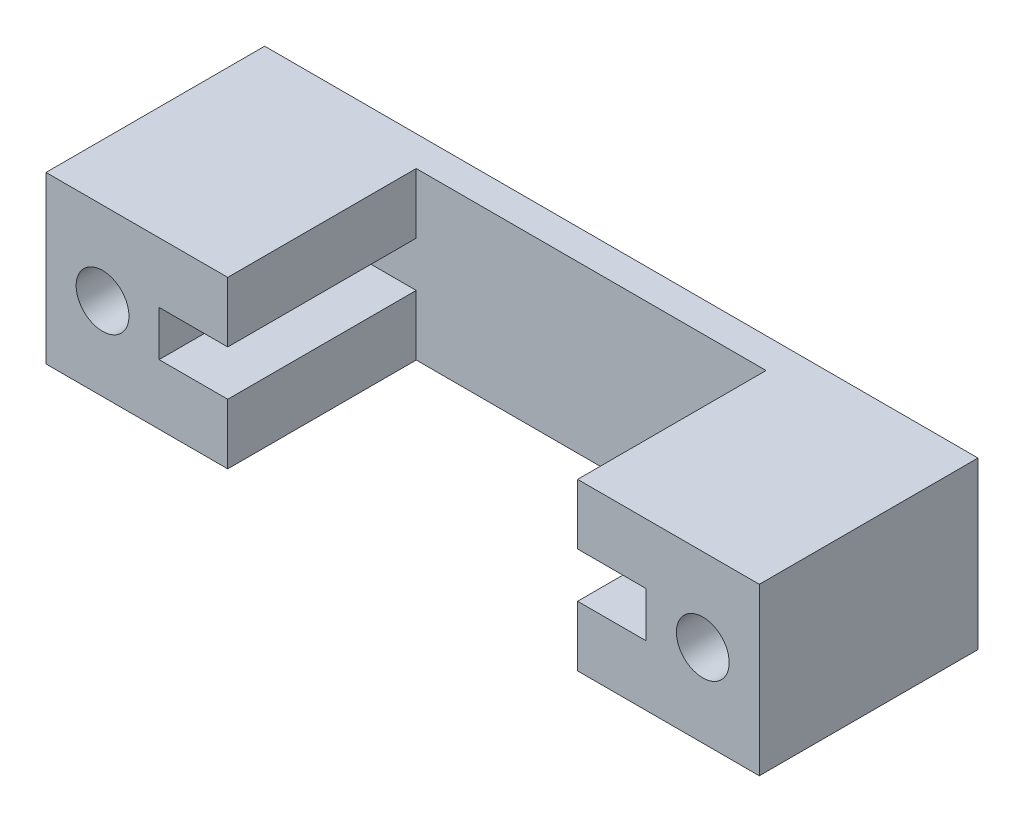
ISO-10303-21;
HEADER;
FILE_DESCRIPTION(('STEP AP214'),'2;1');
FILE_NAME('part.step','',(''),(''),'','','');
FILE_SCHEMA(('AUTOMOTIVE_DESIGN { 1 0 10303 214 1 1 1 1 }'));
ENDSEC;
DATA;
#1=APPLICATION_CONTEXT('core data for automotive mechanical design processes');
#2=APPLICATION_PROTOCOL_DEFINITION('international standard','automotive_design',2000,#1);
#3=PRODUCT_CONTEXT('',#1,'mechanical');
#4=PRODUCT('Part','Part','',(#3));
#5=PRODUCT_RELATED_PRODUCT_CATEGORY('part','',(#4));
#6=PRODUCT_DEFINITION_FORMATION('','',#4);
#7=PRODUCT_DEFINITION_CONTEXT('part definition',#1,'design');
#8=PRODUCT_DEFINITION('design','',#6,#7);
#9=PRODUCT_DEFINITION_SHAPE('','',#8);
#10=(LENGTH_UNIT() NAMED_UNIT(*) SI_UNIT(.MILLI.,.METRE.));
#11=(NAMED_UNIT(*) PLANE_ANGLE_UNIT() SI_UNIT($,.RADIAN.));
#12=(NAMED_UNIT(*) SI_UNIT($,.STERADIAN.) SOLID_ANGLE_UNIT());
#13=UNCERTAINTY_MEASURE_WITH_UNIT(LENGTH_MEASURE(1.E-05),#10,'distance_accuracy_value','');
#14=(GEOMETRIC_REPRESENTATION_CONTEXT(3) GLOBAL_UNCERTAINTY_ASSIGNED_CONTEXT((#13)) GLOBAL_UNIT_ASSIGNED_CONTEXT((#10,
#11,#12)) REPRESENTATION_CONTEXT('',''));
#15=CARTESIAN_POINT('',(0.,0.,0.));
#16=DIRECTION('',(0.,0.,1.));
#17=DIRECTION('',(1.,0.,0.));
#18=AXIS2_PLACEMENT_3D('',#15,#16,#17);
#19=CARTESIAN_POINT('',(0.,0.,2.));
#20=DIRECTION('',(0.,0.,1.));
#21=DIRECTION('',(1.,0.,0.));
#22=AXIS2_PLACEMENT_3D('',#19,#20,#21);
#23=PLANE('',#22);
#24=DIRECTION('',(0.,1.,0.));
#25=VECTOR('',#24,1.);
#26=CARTESIAN_POINT('',(11.6,0.,2.));
#27=LINE('',#26,#25);
#28=CARTESIAN_POINT('',(11.6,-5.5,2.));
#29=VERTEX_POINT('',#28);
#30=CARTESIAN_POINT('',(11.6,-1.5,2.));
#31=VERTEX_POINT('',#30);
#32=EDGE_CURVE('E110',#29,#31,#27,.T.);
#33=ORIENTED_EDGE('',*,*,#32,.T.);
#34=DIRECTION('',(1.,0.,0.));
#35=VECTOR('',#34,1.);
#36=CARTESIAN_POINT('',(0.,-1.5,2.));
#37=LINE('',#36,#35);
#38=CARTESIAN_POINT('',(16.15,-1.5,2.));
#39=VERTEX_POINT('',#38);
#40=EDGE_CURVE('E115',#31,#39,#37,.T.);
#41=ORIENTED_EDGE('',*,*,#40,.T.);
#42=DIRECTION('',(0.,1.,0.));
#43=VECTOR('',#42,1.);
#44=CARTESIAN_POINT('',(16.15,0.,2.));
#45=LINE('',#44,#43);
#46=CARTESIAN_POINT('',(16.15,1.5,2.));
#47=VERTEX_POINT('',#46);
#48=EDGE_CURVE('E250',#39,#47,#45,.T.);
#49=ORIENTED_EDGE('',*,*,#48,.T.);
#50=DIRECTION('',(-1.,0.,0.));
#51=VECTOR('',#50,1.);
#52=CARTESIAN_POINT('',(0.,1.5,2.));
#53=LINE('',#52,#51);
#54=CARTESIAN_POINT('',(11.6,1.5,2.));
#55=VERTEX_POINT('',#54);
#56=EDGE_CURVE('E212',#47,#55,#53,.T.);
#57=ORIENTED_EDGE('',*,*,#56,.T.);
#58=DIRECTION('',(0.,1.,0.));
#59=VECTOR('',#58,1.);
#60=CARTESIAN_POINT('',(11.6,0.,2.));
#61=LINE('',#60,#59);
#62=CARTESIAN_POINT('',(11.6,5.50000000000003,2.));
#63=VERTEX_POINT('',#62);
#64=EDGE_CURVE('E253',#55,#63,#61,.T.);
#65=ORIENTED_EDGE('',*,*,#64,.T.);
#66=DIRECTION('',(-1.,0.,0.));
#67=VECTOR('',#66,1.);
#68=CARTESIAN_POINT('',(0.,5.5,2.));
#69=LINE('',#68,#67);
#70=CARTESIAN_POINT('',(-11.6,5.5,2.));
#71=VERTEX_POINT('',#70);
#72=EDGE_CURVE('E326',#63,#71,#69,.T.);
#73=ORIENTED_EDGE('',*,*,#72,.T.);
#74=DIRECTION('',(0.,-1.,0.));
#75=VECTOR('',#74,1.);
#76=CARTESIAN_POINT('',(-11.6,0.,2.));
#77=LINE('',#76,#75);
#78=CARTESIAN_POINT('',(-11.6,1.5,2.));
#79=VERTEX_POINT('',#78);
#80=EDGE_CURVE('E302',#71,#79,#77,.T.);
#81=ORIENTED_EDGE('',*,*,#80,.T.);
#82=DIRECTION('',(-1.,0.,0.));
#83=VECTOR('',#82,1.);
#84=CARTESIAN_POINT('',(0.,1.5,2.));
#85=LINE('',#84,#83);
#86=CARTESIAN_POINT('',(-16.15,1.5,2.));
#87=VERTEX_POINT('',#86);
#88=EDGE_CURVE('E305',#79,#87,#85,.T.);
#89=ORIENTED_EDGE('',*,*,#88,.T.);
#90=DIRECTION('',(0.,-1.,0.));
#91=VECTOR('',#90,1.);
#92=CARTESIAN_POINT('',(-16.15,0.,2.));
#93=LINE('',#92,#91);
#94=CARTESIAN_POINT('',(-16.15,-1.5,2.));
#95=VERTEX_POINT('',#94);
#96=EDGE_CURVE('E275',#87,#95,#93,.T.);
#97=ORIENTED_EDGE('',*,*,#96,.T.);
#98=DIRECTION('',(1.,0.,0.));
#99=VECTOR('',#98,1.);
#100=CARTESIAN_POINT('',(0.,-1.5,2.));
#101=LINE('',#100,#99);
#102=CARTESIAN_POINT('',(-11.6,-1.5,2.));
#103=VERTEX_POINT('',#102);
#104=EDGE_CURVE('E270',#95,#103,#101,.T.);
#105=ORIENTED_EDGE('',*,*,#104,.T.);
#106=DIRECTION('',(0.,-1.,0.));
#107=VECTOR('',#106,1.);
#108=CARTESIAN_POINT('',(-11.6,0.,2.));
#109=LINE('',#108,#107);
#110=CARTESIAN_POINT('',(-11.6,-5.5,2.));
#111=VERTEX_POINT('',#110);
#112=EDGE_CURVE('E299',#103,#111,#109,.T.);
#113=ORIENTED_EDGE('',*,*,#112,.T.);
#114=DIRECTION('',(1.,0.,0.));
#115=VECTOR('',#114,1.);
#116=CARTESIAN_POINT('',(0.,-5.5,2.));
#117=LINE('',#116,#115);
#118=EDGE_CURVE('E324',#111,#29,#117,.T.);
#119=ORIENTED_EDGE('',*,*,#118,.T.);
#120=EDGE_LOOP('',(#33,#41,#49,#57,#65,#73,#81,#89,#97,#105,#113,#119));
#121=FACE_BOUND('',#120,.T.);
#122=ADVANCED_FACE('F95',(#121),#23,.T.);
#123=CARTESIAN_POINT('',(0.,-5.5,2.));
#124=DIRECTION('',(0.,1.,0.));
#125=DIRECTION('',(0.,0.,1.));
#126=AXIS2_PLACEMENT_3D('',#123,#124,#125);
#127=PLANE('',#126);
#128=DIRECTION('',(1.,0.,0.));
#129=VECTOR('',#128,1.);
#130=CARTESIAN_POINT('',(0.,-5.5,0.));
#131=LINE('',#130,#129);
#132=CARTESIAN_POINT('',(-23.65,-5.5,0.));
#133=VERTEX_POINT('',#132);
#134=CARTESIAN_POINT('',(23.65,-5.5,0.));
#135=VERTEX_POINT('',#134);
#136=EDGE_CURVE('E313',#133,#135,#131,.T.);
#137=ORIENTED_EDGE('',*,*,#136,.T.);
#138=DIRECTION('',(0.,0.,-1.));
#139=VECTOR('',#138,1.);
#140=CARTESIAN_POINT('',(23.65,-5.5,2.));
#141=LINE('',#140,#139);
#142=CARTESIAN_POINT('',(23.65,-5.5,14.5));
#143=VERTEX_POINT('',#142);
#144=EDGE_CURVE('E12',#143,#135,#141,.T.);
#145=ORIENTED_EDGE('',*,*,#144,.F.);
#146=DIRECTION('',(1.,0.,0.));
#147=VECTOR('',#146,1.);
#148=CARTESIAN_POINT('',(0.,-5.50000000000007,14.5));
#149=LINE('',#148,#147);
#150=CARTESIAN_POINT('',(11.6,-5.50000000000003,14.5));
#151=VERTEX_POINT('',#150);
#152=EDGE_CURVE('E243',#151,#143,#149,.T.);
#153=ORIENTED_EDGE('',*,*,#152,.F.);
#154=DIRECTION('',(0.,0.,-1.));
#155=VECTOR('',#154,1.);
#156=CARTESIAN_POINT('',(11.6,-5.50000000000003,14.5));
#157=LINE('',#156,#155);
#158=EDGE_CURVE('E261',#151,#29,#157,.T.);
#159=ORIENTED_EDGE('',*,*,#158,.T.);
#160=ORIENTED_EDGE('',*,*,#118,.F.);
#161=DIRECTION('',(0.,0.,-1.));
#162=VECTOR('',#161,1.);
#163=CARTESIAN_POINT('',(-11.6,-5.5,14.5));
#164=LINE('',#163,#162);
#165=CARTESIAN_POINT('',(-11.6,-5.5,14.5));
#166=VERTEX_POINT('',#165);
#167=EDGE_CURVE('E321',#166,#111,#164,.T.);
#168=ORIENTED_EDGE('',*,*,#167,.F.);
#169=DIRECTION('',(-1.,0.,0.));
#170=VECTOR('',#169,1.);
#171=CARTESIAN_POINT('',(0.,-5.5,14.5));
#172=LINE('',#171,#170);
#173=CARTESIAN_POINT('',(-23.65,-5.5,14.5));
#174=VERTEX_POINT('',#173);
#175=EDGE_CURVE('E278',#166,#174,#172,.T.);
#176=ORIENTED_EDGE('',*,*,#175,.T.);
#177=DIRECTION('',(0.,0.,-1.));
#178=VECTOR('',#177,1.);
#179=CARTESIAN_POINT('',(-23.65,-5.5,2.));
#180=LINE('',#179,#178);
#181=EDGE_CURVE('E329',#174,#133,#180,.T.);
#182=ORIENTED_EDGE('',*,*,#181,.T.);
#183=EDGE_LOOP('',(#137,#145,#153,#159,#160,#168,#176,#182));
#184=FACE_BOUND('',#183,.T.);
#185=ADVANCED_FACE('F97',(#184),#127,.F.);
#186=CARTESIAN_POINT('',(23.65,0.,2.));
#187=DIRECTION('',(1.,0.,0.));
#188=DIRECTION('',(0.,0.,-1.));
#189=AXIS2_PLACEMENT_3D('',#186,#187,#188);
#190=PLANE('',#189);
#191=DIRECTION('',(0.,-1.,0.));
#192=VECTOR('',#191,1.);
#193=CARTESIAN_POINT('',(23.65,0.,0.));
#194=LINE('',#193,#192);
#195=CARTESIAN_POINT('',(23.65,5.5,0.));
#196=VERTEX_POINT('',#195);
#197=EDGE_CURVE('E332',#196,#135,#194,.T.);
#198=ORIENTED_EDGE('',*,*,#197,.F.);
#199=DIRECTION('',(0.,0.,-1.));
#200=VECTOR('',#199,1.);
#201=CARTESIAN_POINT('',(23.65,5.5,2.));
#202=LINE('',#201,#200);
#203=CARTESIAN_POINT('',(23.65,5.5,14.5));
#204=VERTEX_POINT('',#203);
#205=EDGE_CURVE('E103',#204,#196,#202,.T.);
#206=ORIENTED_EDGE('',*,*,#205,.F.);
#207=DIRECTION('',(0.,1.,0.));
#208=VECTOR('',#207,1.);
#209=CARTESIAN_POINT('',(23.65,0.,14.5));
#210=LINE('',#209,#208);
#211=EDGE_CURVE('E240',#143,#204,#210,.T.);
#212=ORIENTED_EDGE('',*,*,#211,.F.);
#213=ORIENTED_EDGE('',*,*,#144,.T.);
#214=EDGE_LOOP('',(#198,#206,#212,#213));
#215=FACE_BOUND('',#214,.T.);
#216=ADVANCED_FACE('F361',(#215),#190,.T.);
#217=CARTESIAN_POINT('',(0.,5.5,2.));
#218=DIRECTION('',(0.,-1.,0.));
#219=DIRECTION('',(1.,0.,0.));
#220=AXIS2_PLACEMENT_3D('',#217,#218,#219);
#221=PLANE('',#220);
#222=DIRECTION('',(-1.,0.,0.));
#223=VECTOR('',#222,1.);
#224=CARTESIAN_POINT('',(0.,5.5,0.));
#225=LINE('',#224,#223);
#226=CARTESIAN_POINT('',(-23.65,5.5,0.));
#227=VERTEX_POINT('',#226);
#228=EDGE_CURVE('E335',#196,#227,#225,.T.);
#229=ORIENTED_EDGE('',*,*,#228,.T.);
#230=DIRECTION('',(0.,0.,-1.));
#231=VECTOR('',#230,1.);
#232=CARTESIAN_POINT('',(-23.65,5.5,2.));
#233=LINE('',#232,#231);
#234=CARTESIAN_POINT('',(-23.65,5.5,14.5));
#235=VERTEX_POINT('',#234);
#236=EDGE_CURVE('E346',#235,#227,#233,.T.);
#237=ORIENTED_EDGE('',*,*,#236,.F.);
#238=DIRECTION('',(1.,0.,0.));
#239=VECTOR('',#238,1.);
#240=CARTESIAN_POINT('',(0.,5.5,14.5));
#241=LINE('',#240,#239);
#242=CARTESIAN_POINT('',(-11.6,5.5,14.5));
#243=VERTEX_POINT('',#242);
#244=EDGE_CURVE('E284',#235,#243,#241,.T.);
#245=ORIENTED_EDGE('',*,*,#244,.T.);
#246=DIRECTION('',(0.,0.,-1.));
#247=VECTOR('',#246,1.);
#248=CARTESIAN_POINT('',(-11.6,5.5,14.5));
#249=LINE('',#248,#247);
#250=EDGE_CURVE('E318',#243,#71,#249,.T.);
#251=ORIENTED_EDGE('',*,*,#250,.T.);
#252=ORIENTED_EDGE('',*,*,#72,.F.);
#253=DIRECTION('',(0.,0.,-1.));
#254=VECTOR('',#253,1.);
#255=CARTESIAN_POINT('',(11.6,5.50000000000003,14.5));
#256=LINE('',#255,#254);
#257=CARTESIAN_POINT('',(11.6,5.50000000000003,14.5));
#258=VERTEX_POINT('',#257);
#259=EDGE_CURVE('E264',#258,#63,#256,.T.);
#260=ORIENTED_EDGE('',*,*,#259,.F.);
#261=DIRECTION('',(-1.,0.,0.));
#262=VECTOR('',#261,1.);
#263=CARTESIAN_POINT('',(0.,5.50000000000007,14.5));
#264=LINE('',#263,#262);
#265=EDGE_CURVE('E238',#204,#258,#264,.T.);
#266=ORIENTED_EDGE('',*,*,#265,.F.);
#267=ORIENTED_EDGE('',*,*,#205,.T.);
#268=EDGE_LOOP('',(#229,#237,#245,#251,#252,#260,#266,#267));
#269=FACE_BOUND('',#268,.T.);
#270=ADVANCED_FACE('F351',(#269),#221,.F.);
#271=CARTESIAN_POINT('',(-19.9,0.,2.));
#272=DIRECTION('',(0.,0.,-1.));
#273=DIRECTION('',(-1.,0.,0.));
#274=AXIS2_PLACEMENT_3D('',#271,#272,#273);
#275=CYLINDRICAL_SURFACE('',#274,1.75);
#276=CARTESIAN_POINT('',(-19.9,0.,0.));
#277=DIRECTION('',(0.,0.,1.));
#278=DIRECTION('',(1.,0.,0.));
#279=AXIS2_PLACEMENT_3D('',#276,#277,#278);
#280=CIRCLE('',#279,1.75);
#281=CARTESIAN_POINT('',(-18.15,0.,0.));
#282=VERTEX_POINT('',#281);
#283=EDGE_CURVE('E339',#282,#282,#280,.T.);
#284=ORIENTED_EDGE('',*,*,#283,.F.);
#285=EDGE_LOOP('',(#284));
#286=FACE_BOUND('',#285,.T.);
#287=CARTESIAN_POINT('',(-19.9,0.,14.5));
#288=DIRECTION('',(0.,0.,1.));
#289=DIRECTION('',(1.,0.,0.));
#290=AXIS2_PLACEMENT_3D('',#287,#288,#289);
#291=CIRCLE('',#290,1.75);
#292=CARTESIAN_POINT('',(-18.15,0.,14.5));
#293=VERTEX_POINT('',#292);
#294=EDGE_CURVE('E258',#293,#293,#291,.T.);
#295=ORIENTED_EDGE('',*,*,#294,.T.);
#296=EDGE_LOOP('',(#295));
#297=FACE_BOUND('',#296,.T.);
#298=ADVANCED_FACE('F409',(#286,#297),#275,.F.);
#299=CARTESIAN_POINT('',(-23.65,0.,2.));
#300=DIRECTION('',(1.,0.,0.));
#301=DIRECTION('',(0.,0.,-1.));
#302=AXIS2_PLACEMENT_3D('',#299,#300,#301);
#303=PLANE('',#302);
#304=DIRECTION('',(0.,-1.,0.));
#305=VECTOR('',#304,1.);
#306=CARTESIAN_POINT('',(-23.65,0.,0.));
#307=LINE('',#306,#305);
#308=EDGE_CURVE('E337',#227,#133,#307,.T.);
#309=ORIENTED_EDGE('',*,*,#308,.T.);
#310=ORIENTED_EDGE('',*,*,#181,.F.);
#311=DIRECTION('',(0.,1.,0.));
#312=VECTOR('',#311,1.);
#313=CARTESIAN_POINT('',(-23.65,0.,14.5));
#314=LINE('',#313,#312);
#315=EDGE_CURVE('E281',#174,#235,#314,.T.);
#316=ORIENTED_EDGE('',*,*,#315,.T.);
#317=ORIENTED_EDGE('',*,*,#236,.T.);
#318=EDGE_LOOP('',(#309,#310,#316,#317));
#319=FACE_BOUND('',#318,.T.);
#320=ADVANCED_FACE('F367',(#319),#303,.F.);
#321=CARTESIAN_POINT('',(19.9,0.,2.));
#322=DIRECTION('',(0.,0.,-1.));
#323=DIRECTION('',(-1.,0.,0.));
#324=AXIS2_PLACEMENT_3D('',#321,#322,#323);
#325=CYLINDRICAL_SURFACE('',#324,1.75);
#326=CARTESIAN_POINT('',(19.9,0.,0.));
#327=DIRECTION('',(0.,0.,1.));
#328=DIRECTION('',(1.,0.,0.));
#329=AXIS2_PLACEMENT_3D('',#326,#327,#328);
#330=CIRCLE('',#329,1.75);
#331=CARTESIAN_POINT('',(21.65,0.,0.));
#332=VERTEX_POINT('',#331);
#333=EDGE_CURVE('E327',#332,#332,#330,.T.);
#334=ORIENTED_EDGE('',*,*,#333,.F.);
#335=EDGE_LOOP('',(#334));
#336=FACE_BOUND('',#335,.T.);
#337=CARTESIAN_POINT('',(19.9,0.,14.5));
#338=DIRECTION('',(0.,0.,1.));
#339=DIRECTION('',(1.,0.,0.));
#340=AXIS2_PLACEMENT_3D('',#337,#338,#339);
#341=CIRCLE('',#340,1.75);
#342=CARTESIAN_POINT('',(21.65,0.,14.5));
#343=VERTEX_POINT('',#342);
#344=EDGE_CURVE('E235',#343,#343,#341,.T.);
#345=ORIENTED_EDGE('',*,*,#344,.T.);
#346=EDGE_LOOP('',(#345));
#347=FACE_BOUND('',#346,.T.);
#348=ADVANCED_FACE('F405',(#336,#347),#325,.F.);
#349=CARTESIAN_POINT('',(0.,0.,0.));
#350=DIRECTION('',(0.,0.,1.));
#351=DIRECTION('',(1.,0.,0.));
#352=AXIS2_PLACEMENT_3D('',#349,#350,#351);
#353=PLANE('',#352);
#354=ORIENTED_EDGE('',*,*,#136,.F.);
#355=ORIENTED_EDGE('',*,*,#308,.F.);
#356=ORIENTED_EDGE('',*,*,#228,.F.);
#357=ORIENTED_EDGE('',*,*,#197,.T.);
#358=EDGE_LOOP('',(#354,#355,#356,#357));
#359=FACE_BOUND('',#358,.T.);
#360=ORIENTED_EDGE('',*,*,#283,.T.);
#361=EDGE_LOOP('',(#360));
#362=FACE_BOUND('',#361,.T.);
#363=ORIENTED_EDGE('',*,*,#333,.T.);
#364=EDGE_LOOP('',(#363));
#365=FACE_BOUND('',#364,.T.);
#366=ADVANCED_FACE('F359',(#359,#362,#365),#353,.F.);
#367=CARTESIAN_POINT('',(0.,0.,14.5));
#368=DIRECTION('',(0.,0.,-1.));
#369=DIRECTION('',(-1.,0.,0.));
#370=AXIS2_PLACEMENT_3D('',#367,#368,#369);
#371=PLANE('',#370);
#372=DIRECTION('',(1.,0.,0.));
#373=VECTOR('',#372,1.);
#374=CARTESIAN_POINT('',(0.,-1.5,14.5));
#375=LINE('',#374,#373);
#376=CARTESIAN_POINT('',(-16.15,-1.5,14.5));
#377=VERTEX_POINT('',#376);
#378=CARTESIAN_POINT('',(-11.6,-1.5,14.5));
#379=VERTEX_POINT('',#378);
#380=EDGE_CURVE('E271',#377,#379,#375,.T.);
#381=ORIENTED_EDGE('',*,*,#380,.F.);
#382=DIRECTION('',(0.,-1.,0.));
#383=VECTOR('',#382,1.);
#384=CARTESIAN_POINT('',(-16.15,0.,14.5));
#385=LINE('',#384,#383);
#386=CARTESIAN_POINT('',(-16.15,1.5,14.5));
#387=VERTEX_POINT('',#386);
#388=EDGE_CURVE('E293',#387,#377,#385,.T.);
#389=ORIENTED_EDGE('',*,*,#388,.F.);
#390=DIRECTION('',(-1.,0.,0.));
#391=VECTOR('',#390,1.);
#392=CARTESIAN_POINT('',(0.,1.5,14.5));
#393=LINE('',#392,#391);
#394=CARTESIAN_POINT('',(-11.6,1.5,14.5));
#395=VERTEX_POINT('',#394);
#396=EDGE_CURVE('E290',#395,#387,#393,.T.);
#397=ORIENTED_EDGE('',*,*,#396,.F.);
#398=DIRECTION('',(0.,-1.,0.));
#399=VECTOR('',#398,1.);
#400=CARTESIAN_POINT('',(-11.6,0.,14.5));
#401=LINE('',#400,#399);
#402=EDGE_CURVE('E287',#243,#395,#401,.T.);
#403=ORIENTED_EDGE('',*,*,#402,.F.);
#404=ORIENTED_EDGE('',*,*,#244,.F.);
#405=ORIENTED_EDGE('',*,*,#315,.F.);
#406=ORIENTED_EDGE('',*,*,#175,.F.);
#407=DIRECTION('',(0.,-1.,0.));
#408=VECTOR('',#407,1.);
#409=CARTESIAN_POINT('',(-11.6,0.,14.5));
#410=LINE('',#409,#408);
#411=EDGE_CURVE('E274',#379,#166,#410,.T.);
#412=ORIENTED_EDGE('',*,*,#411,.F.);
#413=EDGE_LOOP('',(#381,#389,#397,#403,#404,#405,#406,#412));
#414=FACE_BOUND('',#413,.T.);
#415=ORIENTED_EDGE('',*,*,#294,.F.);
#416=EDGE_LOOP('',(#415));
#417=FACE_BOUND('',#416,.T.);
#418=ADVANCED_FACE('F371',(#414,#417),#371,.F.);
#419=CARTESIAN_POINT('',(0.,-1.5,14.5));
#420=DIRECTION('',(0.,1.,0.));
#421=DIRECTION('',(-1.,0.,0.));
#422=AXIS2_PLACEMENT_3D('',#419,#420,#421);
#423=PLANE('',#422);
#424=ORIENTED_EDGE('',*,*,#104,.F.);
#425=DIRECTION('',(0.,0.,-1.));
#426=VECTOR('',#425,1.);
#427=CARTESIAN_POINT('',(-16.15,-1.5,14.5));
#428=LINE('',#427,#426);
#429=EDGE_CURVE('E310',#377,#95,#428,.T.);
#430=ORIENTED_EDGE('',*,*,#429,.F.);
#431=ORIENTED_EDGE('',*,*,#380,.T.);
#432=DIRECTION('',(0.,0.,-1.));
#433=VECTOR('',#432,1.);
#434=CARTESIAN_POINT('',(-11.6,-1.5,14.5));
#435=LINE('',#434,#433);
#436=EDGE_CURVE('E296',#379,#103,#435,.T.);
#437=ORIENTED_EDGE('',*,*,#436,.T.);
#438=EDGE_LOOP('',(#424,#430,#431,#437));
#439=FACE_BOUND('',#438,.T.);
#440=ADVANCED_FACE('F402',(#439),#423,.T.);
#441=CARTESIAN_POINT('',(-16.15,0.,14.5));
#442=DIRECTION('',(1.,0.,0.));
#443=DIRECTION('',(0.,0.,-1.));
#444=AXIS2_PLACEMENT_3D('',#441,#442,#443);
#445=PLANE('',#444);
#446=ORIENTED_EDGE('',*,*,#96,.F.);
#447=DIRECTION('',(0.,0.,-1.));
#448=VECTOR('',#447,1.);
#449=CARTESIAN_POINT('',(-16.15,1.5,14.5));
#450=LINE('',#449,#448);
#451=EDGE_CURVE('E314',#387,#87,#450,.T.);
#452=ORIENTED_EDGE('',*,*,#451,.F.);
#453=ORIENTED_EDGE('',*,*,#388,.T.);
#454=ORIENTED_EDGE('',*,*,#429,.T.);
#455=EDGE_LOOP('',(#446,#452,#453,#454));
#456=FACE_BOUND('',#455,.T.);
#457=ADVANCED_FACE('F455',(#456),#445,.T.);
#458=CARTESIAN_POINT('',(0.,1.5,14.5));
#459=DIRECTION('',(0.,-1.,0.));
#460=DIRECTION('',(1.,0.,0.));
#461=AXIS2_PLACEMENT_3D('',#458,#459,#460);
#462=PLANE('',#461);
#463=ORIENTED_EDGE('',*,*,#88,.F.);
#464=DIRECTION('',(0.,0.,-1.));
#465=VECTOR('',#464,1.);
#466=CARTESIAN_POINT('',(-11.6,1.5,14.5));
#467=LINE('',#466,#465);
#468=EDGE_CURVE('E316',#395,#79,#467,.T.);
#469=ORIENTED_EDGE('',*,*,#468,.F.);
#470=ORIENTED_EDGE('',*,*,#396,.T.);
#471=ORIENTED_EDGE('',*,*,#451,.T.);
#472=EDGE_LOOP('',(#463,#469,#470,#471));
#473=FACE_BOUND('',#472,.T.);
#474=ADVANCED_FACE('F463',(#473),#462,.T.);
#475=CARTESIAN_POINT('',(-11.6,0.,14.5));
#476=DIRECTION('',(1.,0.,0.));
#477=DIRECTION('',(0.,0.,-1.));
#478=AXIS2_PLACEMENT_3D('',#475,#476,#477);
#479=PLANE('',#478);
#480=ORIENTED_EDGE('',*,*,#80,.F.);
#481=ORIENTED_EDGE('',*,*,#250,.F.);
#482=ORIENTED_EDGE('',*,*,#402,.T.);
#483=ORIENTED_EDGE('',*,*,#468,.T.);
#484=EDGE_LOOP('',(#480,#481,#482,#483));
#485=FACE_BOUND('',#484,.T.);
#486=ADVANCED_FACE('F378',(#485),#479,.T.);
#487=CARTESIAN_POINT('',(-11.6,0.,14.5));
#488=DIRECTION('',(1.,0.,0.));
#489=DIRECTION('',(0.,0.,-1.));
#490=AXIS2_PLACEMENT_3D('',#487,#488,#489);
#491=PLANE('',#490);
#492=ORIENTED_EDGE('',*,*,#112,.F.);
#493=ORIENTED_EDGE('',*,*,#436,.F.);
#494=ORIENTED_EDGE('',*,*,#411,.T.);
#495=ORIENTED_EDGE('',*,*,#167,.T.);
#496=EDGE_LOOP('',(#492,#493,#494,#495));
#497=FACE_BOUND('',#496,.T.);
#498=ADVANCED_FACE('F480',(#497),#491,.T.);
#499=CARTESIAN_POINT('',(0.,0.,14.5));
#500=DIRECTION('',(0.,0.,1.));
#501=DIRECTION('',(1.,0.,0.));
#502=AXIS2_PLACEMENT_3D('',#499,#500,#501);
#503=PLANE('',#502);
#504=DIRECTION('',(0.,1.,0.));
#505=VECTOR('',#504,1.);
#506=CARTESIAN_POINT('',(16.15,0.,14.5));
#507=LINE('',#506,#505);
#508=CARTESIAN_POINT('',(16.15,-1.5,14.5));
#509=VERTEX_POINT('',#508);
#510=CARTESIAN_POINT('',(16.15,1.5,14.5));
#511=VERTEX_POINT('',#510);
#512=EDGE_CURVE('E225',#509,#511,#507,.T.);
#513=ORIENTED_EDGE('',*,*,#512,.F.);
#514=DIRECTION('',(1.,0.,0.));
#515=VECTOR('',#514,1.);
#516=CARTESIAN_POINT('',(0.,-1.5,14.5));
#517=LINE('',#516,#515);
#518=CARTESIAN_POINT('',(11.6,-1.5,14.5));
#519=VERTEX_POINT('',#518);
#520=EDGE_CURVE('E217',#519,#509,#517,.T.);
#521=ORIENTED_EDGE('',*,*,#520,.F.);
#522=DIRECTION('',(0.,1.,0.));
#523=VECTOR('',#522,1.);
#524=CARTESIAN_POINT('',(11.6,0.,14.5));
#525=LINE('',#524,#523);
#526=EDGE_CURVE('E246',#151,#519,#525,.T.);
#527=ORIENTED_EDGE('',*,*,#526,.F.);
#528=ORIENTED_EDGE('',*,*,#152,.T.);
#529=ORIENTED_EDGE('',*,*,#211,.T.);
#530=ORIENTED_EDGE('',*,*,#265,.T.);
#531=DIRECTION('',(0.,1.,0.));
#532=VECTOR('',#531,1.);
#533=CARTESIAN_POINT('',(11.6,0.,14.5));
#534=LINE('',#533,#532);
#535=CARTESIAN_POINT('',(11.6,1.5,14.5));
#536=VERTEX_POINT('',#535);
#537=EDGE_CURVE('E228',#536,#258,#534,.T.);
#538=ORIENTED_EDGE('',*,*,#537,.F.);
#539=DIRECTION('',(-1.,0.,0.));
#540=VECTOR('',#539,1.);
#541=CARTESIAN_POINT('',(0.,1.5,14.5));
#542=LINE('',#541,#540);
#543=EDGE_CURVE('E211',#511,#536,#542,.T.);
#544=ORIENTED_EDGE('',*,*,#543,.F.);
#545=EDGE_LOOP('',(#513,#521,#527,#528,#529,#530,#538,#544));
#546=FACE_BOUND('',#545,.T.);
#547=ORIENTED_EDGE('',*,*,#344,.F.);
#548=EDGE_LOOP('',(#547));
#549=FACE_BOUND('',#548,.T.);
#550=ADVANCED_FACE('F222',(#546,#549),#503,.T.);
#551=CARTESIAN_POINT('',(16.15,0.,14.5));
#552=DIRECTION('',(-1.,0.,0.));
#553=DIRECTION('',(0.,0.,1.));
#554=AXIS2_PLACEMENT_3D('',#551,#552,#553);
#555=PLANE('',#554);
#556=ORIENTED_EDGE('',*,*,#48,.F.);
#557=DIRECTION('',(0.,0.,-1.));
#558=VECTOR('',#557,1.);
#559=CARTESIAN_POINT('',(16.15,-1.5,14.5));
#560=LINE('',#559,#558);
#561=EDGE_CURVE('E231',#509,#39,#560,.T.);
#562=ORIENTED_EDGE('',*,*,#561,.F.);
#563=ORIENTED_EDGE('',*,*,#512,.T.);
#564=DIRECTION('',(0.,0.,-1.));
#565=VECTOR('',#564,1.);
#566=CARTESIAN_POINT('',(16.15,1.5,14.5));
#567=LINE('',#566,#565);
#568=EDGE_CURVE('E207',#511,#47,#567,.T.);
#569=ORIENTED_EDGE('',*,*,#568,.T.);
#570=EDGE_LOOP('',(#556,#562,#563,#569));
#571=FACE_BOUND('',#570,.T.);
#572=ADVANCED_FACE('F230',(#571),#555,.T.);
#573=CARTESIAN_POINT('',(0.,-1.5,14.5));
#574=DIRECTION('',(0.,1.,0.));
#575=DIRECTION('',(-1.,0.,0.));
#576=AXIS2_PLACEMENT_3D('',#573,#574,#575);
#577=PLANE('',#576);
#578=ORIENTED_EDGE('',*,*,#40,.F.);
#579=DIRECTION('',(0.,0.,-1.));
#580=VECTOR('',#579,1.);
#581=CARTESIAN_POINT('',(11.6,-1.5,14.5));
#582=LINE('',#581,#580);
#583=EDGE_CURVE('E259',#519,#31,#582,.T.);
#584=ORIENTED_EDGE('',*,*,#583,.F.);
#585=ORIENTED_EDGE('',*,*,#520,.T.);
#586=ORIENTED_EDGE('',*,*,#561,.T.);
#587=EDGE_LOOP('',(#578,#584,#585,#586));
#588=FACE_BOUND('',#587,.T.);
#589=ADVANCED_FACE('F391',(#588),#577,.T.);
#590=CARTESIAN_POINT('',(11.6,0.,14.5));
#591=DIRECTION('',(-1.,0.,0.));
#592=DIRECTION('',(0.,0.,1.));
#593=AXIS2_PLACEMENT_3D('',#590,#591,#592);
#594=PLANE('',#593);
#595=ORIENTED_EDGE('',*,*,#32,.F.);
#596=ORIENTED_EDGE('',*,*,#158,.F.);
#597=ORIENTED_EDGE('',*,*,#526,.T.);
#598=ORIENTED_EDGE('',*,*,#583,.T.);
#599=EDGE_LOOP('',(#595,#596,#597,#598));
#600=FACE_BOUND('',#599,.T.);
#601=ADVANCED_FACE('F384',(#600),#594,.T.);
#602=CARTESIAN_POINT('',(11.6,0.,14.5));
#603=DIRECTION('',(-1.,0.,0.));
#604=DIRECTION('',(0.,0.,1.));
#605=AXIS2_PLACEMENT_3D('',#602,#603,#604);
#606=PLANE('',#605);
#607=ORIENTED_EDGE('',*,*,#64,.F.);
#608=DIRECTION('',(0.,0.,-1.));
#609=VECTOR('',#608,1.);
#610=CARTESIAN_POINT('',(11.6,1.5,14.5));
#611=LINE('',#610,#609);
#612=EDGE_CURVE('E216',#536,#55,#611,.T.);
#613=ORIENTED_EDGE('',*,*,#612,.F.);
#614=ORIENTED_EDGE('',*,*,#537,.T.);
#615=ORIENTED_EDGE('',*,*,#259,.T.);
#616=EDGE_LOOP('',(#607,#613,#614,#615));
#617=FACE_BOUND('',#616,.T.);
#618=ADVANCED_FACE('F382',(#617),#606,.T.);
#619=CARTESIAN_POINT('',(0.,1.5,14.5));
#620=DIRECTION('',(0.,-1.,0.));
#621=DIRECTION('',(1.,0.,0.));
#622=AXIS2_PLACEMENT_3D('',#619,#620,#621);
#623=PLANE('',#622);
#624=ORIENTED_EDGE('',*,*,#56,.F.);
#625=ORIENTED_EDGE('',*,*,#568,.F.);
#626=ORIENTED_EDGE('',*,*,#543,.T.);
#627=ORIENTED_EDGE('',*,*,#612,.T.);
#628=EDGE_LOOP('',(#624,#625,#626,#627));
#629=FACE_BOUND('',#628,.T.);
#630=ADVANCED_FACE('F209',(#629),#623,.T.);
#631=CLOSED_SHELL('',(#122,#185,#216,#270,#298,#320,#348,#366,#418,#440,#457,#474,#486,#498,
#550,#572,#589,#601,#618,#630));
#632=MANIFOLD_SOLID_BREP('B2',#631);
#633=ADVANCED_BREP_SHAPE_REPRESENTATION('',(#18,#632),#14);
#634=SHAPE_DEFINITION_REPRESENTATION(#9,#633);
ENDSEC;
END-ISO-10303-21;
